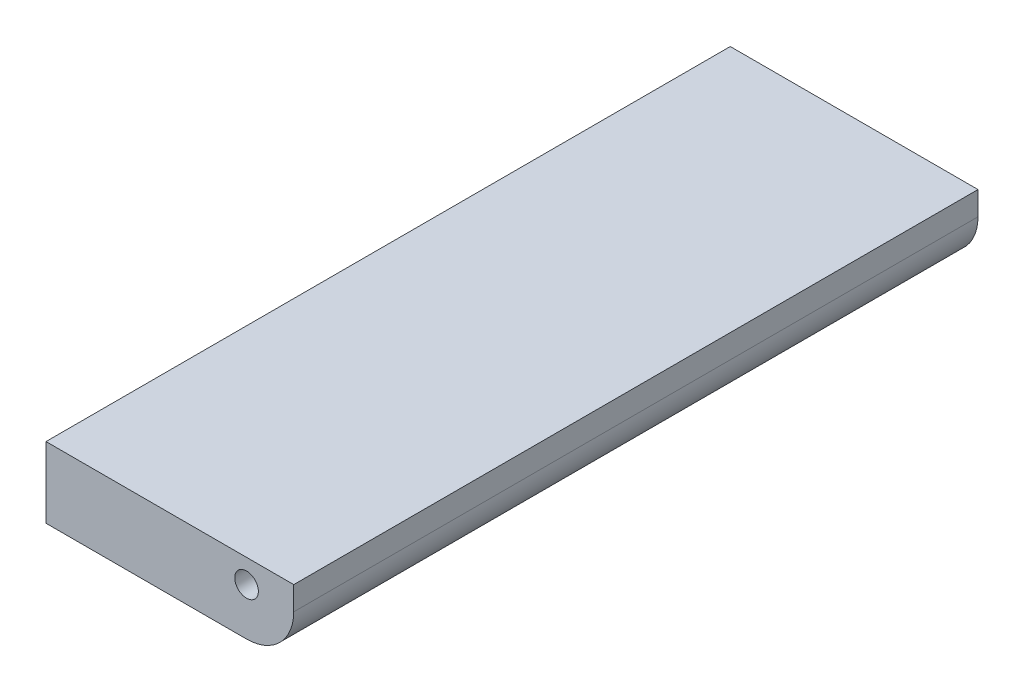
ISO-10303-21;
HEADER;
FILE_DESCRIPTION(('STEP AP214'),'2;1');
FILE_NAME('part.step','',(''),(''),'','','');
FILE_SCHEMA(('AUTOMOTIVE_DESIGN { 1 0 10303 214 1 1 1 1 }'));
ENDSEC;
DATA;
#1=APPLICATION_CONTEXT('core data for automotive mechanical design processes');
#2=APPLICATION_PROTOCOL_DEFINITION('international standard','automotive_design',2000,#1);
#3=PRODUCT_CONTEXT('',#1,'mechanical');
#4=PRODUCT('Part','Part','',(#3));
#5=PRODUCT_RELATED_PRODUCT_CATEGORY('part','',(#4));
#6=PRODUCT_DEFINITION_FORMATION('','',#4);
#7=PRODUCT_DEFINITION_CONTEXT('part definition',#1,'design');
#8=PRODUCT_DEFINITION('design','',#6,#7);
#9=PRODUCT_DEFINITION_SHAPE('','',#8);
#10=(LENGTH_UNIT() NAMED_UNIT(*) SI_UNIT(.MILLI.,.METRE.));
#11=(NAMED_UNIT(*) PLANE_ANGLE_UNIT() SI_UNIT($,.RADIAN.));
#12=(NAMED_UNIT(*) SI_UNIT($,.STERADIAN.) SOLID_ANGLE_UNIT());
#13=UNCERTAINTY_MEASURE_WITH_UNIT(LENGTH_MEASURE(1.E-05),#10,'distance_accuracy_value','');
#14=(GEOMETRIC_REPRESENTATION_CONTEXT(3) GLOBAL_UNCERTAINTY_ASSIGNED_CONTEXT((#13)) GLOBAL_UNIT_ASSIGNED_CONTEXT((#10,
#11,#12)) REPRESENTATION_CONTEXT('',''));
#15=CARTESIAN_POINT('',(0.,0.,0.));
#16=DIRECTION('',(0.,0.,1.));
#17=DIRECTION('',(1.,0.,0.));
#18=AXIS2_PLACEMENT_3D('',#15,#16,#17);
#19=CARTESIAN_POINT('',(0.,0.,290.));
#20=DIRECTION('',(-1.,0.,0.));
#21=DIRECTION('',(0.,-1.,0.));
#22=AXIS2_PLACEMENT_3D('',#19,#20,#21);
#23=PLANE('',#22);
#24=DIRECTION('',(0.,1.,0.));
#25=VECTOR('',#24,1.);
#26=CARTESIAN_POINT('',(0.,0.,0.));
#27=LINE('',#26,#25);
#28=CARTESIAN_POINT('',(0.,-10.,0.));
#29=VERTEX_POINT('',#28);
#30=CARTESIAN_POINT('',(0.,0.,0.));
#31=VERTEX_POINT('',#30);
#32=EDGE_CURVE('E110',#29,#31,#27,.T.);
#33=ORIENTED_EDGE('',*,*,#32,.T.);
#34=DIRECTION('',(0.,0.,-1.));
#35=VECTOR('',#34,1.);
#36=CARTESIAN_POINT('',(0.,0.,290.));
#37=LINE('',#36,#35);
#38=CARTESIAN_POINT('',(0.,0.,290.));
#39=VERTEX_POINT('',#38);
#40=EDGE_CURVE('E11',#39,#31,#37,.T.);
#41=ORIENTED_EDGE('',*,*,#40,.F.);
#42=DIRECTION('',(0.,1.,0.));
#43=VECTOR('',#42,1.);
#44=CARTESIAN_POINT('',(0.,0.,290.));
#45=LINE('',#44,#43);
#46=CARTESIAN_POINT('',(0.,-10.,290.));
#47=VERTEX_POINT('',#46);
#48=EDGE_CURVE('E119',#47,#39,#45,.T.);
#49=ORIENTED_EDGE('',*,*,#48,.F.);
#50=DIRECTION('',(0.,0.,-1.));
#51=VECTOR('',#50,1.);
#52=CARTESIAN_POINT('',(0.,-10.,290.));
#53=LINE('',#52,#51);
#54=EDGE_CURVE('E106',#47,#29,#53,.T.);
#55=ORIENTED_EDGE('',*,*,#54,.T.);
#56=EDGE_LOOP('',(#33,#41,#49,#55));
#57=FACE_BOUND('',#56,.T.);
#58=ADVANCED_FACE('F36',(#57),#23,.F.);
#59=CARTESIAN_POINT('',(0.,0.,290.));
#60=DIRECTION('',(0.,-1.,0.));
#61=DIRECTION('',(1.,0.,0.));
#62=AXIS2_PLACEMENT_3D('',#59,#60,#61);
#63=PLANE('',#62);
#64=DIRECTION('',(-1.,0.,0.));
#65=VECTOR('',#64,1.);
#66=CARTESIAN_POINT('',(0.,0.,0.));
#67=LINE('',#66,#65);
#68=CARTESIAN_POINT('',(-105.,0.,0.));
#69=VERTEX_POINT('',#68);
#70=EDGE_CURVE('E113',#31,#69,#67,.T.);
#71=ORIENTED_EDGE('',*,*,#70,.T.);
#72=DIRECTION('',(0.,0.,-1.));
#73=VECTOR('',#72,1.);
#74=CARTESIAN_POINT('',(-105.,0.,290.));
#75=LINE('',#74,#73);
#76=CARTESIAN_POINT('',(-105.,0.,290.));
#77=VERTEX_POINT('',#76);
#78=EDGE_CURVE('E44',#77,#69,#75,.T.);
#79=ORIENTED_EDGE('',*,*,#78,.F.);
#80=DIRECTION('',(-1.,0.,0.));
#81=VECTOR('',#80,1.);
#82=CARTESIAN_POINT('',(0.,0.,290.));
#83=LINE('',#82,#81);
#84=EDGE_CURVE('E86',#39,#77,#83,.T.);
#85=ORIENTED_EDGE('',*,*,#84,.F.);
#86=ORIENTED_EDGE('',*,*,#40,.T.);
#87=EDGE_LOOP('',(#71,#79,#85,#86));
#88=FACE_BOUND('',#87,.T.);
#89=ADVANCED_FACE('F139',(#88),#63,.F.);
#90=CARTESIAN_POINT('',(-105.,0.,290.));
#91=DIRECTION('',(1.,0.,0.));
#92=DIRECTION('',(0.,0.,-1.));
#93=AXIS2_PLACEMENT_3D('',#90,#91,#92);
#94=PLANE('',#93);
#95=DIRECTION('',(0.,-1.,0.));
#96=VECTOR('',#95,1.);
#97=CARTESIAN_POINT('',(-105.,0.,0.));
#98=LINE('',#97,#96);
#99=CARTESIAN_POINT('',(-105.,-30.,0.));
#100=VERTEX_POINT('',#99);
#101=EDGE_CURVE('E101',#69,#100,#98,.T.);
#102=ORIENTED_EDGE('',*,*,#101,.T.);
#103=DIRECTION('',(0.,0.,-1.));
#104=VECTOR('',#103,1.);
#105=CARTESIAN_POINT('',(-105.,-30.,290.));
#106=LINE('',#105,#104);
#107=CARTESIAN_POINT('',(-105.,-30.,290.));
#108=VERTEX_POINT('',#107);
#109=EDGE_CURVE('E98',#108,#100,#106,.T.);
#110=ORIENTED_EDGE('',*,*,#109,.F.);
#111=DIRECTION('',(0.,-1.,0.));
#112=VECTOR('',#111,1.);
#113=CARTESIAN_POINT('',(-105.,0.,290.));
#114=LINE('',#113,#112);
#115=EDGE_CURVE('E90',#77,#108,#114,.T.);
#116=ORIENTED_EDGE('',*,*,#115,.F.);
#117=ORIENTED_EDGE('',*,*,#78,.T.);
#118=EDGE_LOOP('',(#102,#110,#116,#117));
#119=FACE_BOUND('',#118,.T.);
#120=ADVANCED_FACE('F99',(#119),#94,.F.);
#121=CARTESIAN_POINT('',(-20.,-30.,290.));
#122=DIRECTION('',(0.,1.,0.));
#123=DIRECTION('',(-1.,0.,0.));
#124=AXIS2_PLACEMENT_3D('',#121,#122,#123);
#125=PLANE('',#124);
#126=DIRECTION('',(1.,0.,0.));
#127=VECTOR('',#126,1.);
#128=CARTESIAN_POINT('',(-20.,-30.,0.));
#129=LINE('',#128,#127);
#130=CARTESIAN_POINT('',(-20.,-30.,0.));
#131=VERTEX_POINT('',#130);
#132=EDGE_CURVE('E72',#100,#131,#129,.T.);
#133=ORIENTED_EDGE('',*,*,#132,.T.);
#134=DIRECTION('',(0.,0.,-1.));
#135=VECTOR('',#134,1.);
#136=CARTESIAN_POINT('',(-20.,-30.,290.));
#137=LINE('',#136,#135);
#138=CARTESIAN_POINT('',(-20.,-30.,290.));
#139=VERTEX_POINT('',#138);
#140=EDGE_CURVE('E102',#139,#131,#137,.T.);
#141=ORIENTED_EDGE('',*,*,#140,.F.);
#142=DIRECTION('',(1.,0.,0.));
#143=VECTOR('',#142,1.);
#144=CARTESIAN_POINT('',(-20.,-30.,290.));
#145=LINE('',#144,#143);
#146=EDGE_CURVE('E94',#108,#139,#145,.T.);
#147=ORIENTED_EDGE('',*,*,#146,.F.);
#148=ORIENTED_EDGE('',*,*,#109,.T.);
#149=EDGE_LOOP('',(#133,#141,#147,#148));
#150=FACE_BOUND('',#149,.T.);
#151=ADVANCED_FACE('F104',(#150),#125,.F.);
#152=CARTESIAN_POINT('',(-20.,-10.,290.));
#153=DIRECTION('',(0.,0.,-1.));
#154=DIRECTION('',(-1.,0.,0.));
#155=AXIS2_PLACEMENT_3D('',#152,#153,#154);
#156=CYLINDRICAL_SURFACE('',#155,20.);
#157=CARTESIAN_POINT('',(-20.,-10.,0.));
#158=DIRECTION('',(0.,0.,1.));
#159=DIRECTION('',(1.,0.,0.));
#160=AXIS2_PLACEMENT_3D('',#157,#158,#159);
#161=CIRCLE('',#160,20.);
#162=EDGE_CURVE('E78',#131,#29,#161,.T.);
#163=ORIENTED_EDGE('',*,*,#162,.T.);
#164=ORIENTED_EDGE('',*,*,#54,.F.);
#165=CARTESIAN_POINT('',(-20.,-10.,290.));
#166=DIRECTION('',(0.,0.,1.));
#167=DIRECTION('',(1.,0.,0.));
#168=AXIS2_PLACEMENT_3D('',#165,#166,#167);
#169=CIRCLE('',#168,20.);
#170=EDGE_CURVE('E52',#139,#47,#169,.T.);
#171=ORIENTED_EDGE('',*,*,#170,.F.);
#172=ORIENTED_EDGE('',*,*,#140,.T.);
#173=EDGE_LOOP('',(#163,#164,#171,#172));
#174=FACE_BOUND('',#173,.T.);
#175=ADVANCED_FACE('F127',(#174),#156,.T.);
#176=CARTESIAN_POINT('',(-20.,-10.,290.));
#177=DIRECTION('',(0.,0.,1.));
#178=DIRECTION('',(1.,0.,0.));
#179=AXIS2_PLACEMENT_3D('',#176,#177,#178);
#180=PLANE('',#179);
#181=CARTESIAN_POINT('',(-20.,-10.,290.));
#182=DIRECTION('',(0.,0.,1.));
#183=DIRECTION('',(1.,0.,0.));
#184=AXIS2_PLACEMENT_3D('',#181,#182,#183);
#185=CIRCLE('',#184,5.);
#186=CARTESIAN_POINT('',(-15.,-10.,290.));
#187=VERTEX_POINT('',#186);
#188=EDGE_CURVE('E190',#187,#187,#185,.T.);
#189=ORIENTED_EDGE('',*,*,#188,.F.);
#190=EDGE_LOOP('',(#189));
#191=FACE_BOUND('',#190,.T.);
#192=ORIENTED_EDGE('',*,*,#48,.T.);
#193=ORIENTED_EDGE('',*,*,#84,.T.);
#194=ORIENTED_EDGE('',*,*,#115,.T.);
#195=ORIENTED_EDGE('',*,*,#146,.T.);
#196=ORIENTED_EDGE('',*,*,#170,.T.);
#197=EDGE_LOOP('',(#192,#193,#194,#195,#196));
#198=FACE_BOUND('',#197,.T.);
#199=ADVANCED_FACE('F92',(#191,#198),#180,.T.);
#200=CARTESIAN_POINT('',(-20.,-10.,0.));
#201=DIRECTION('',(0.,0.,1.));
#202=DIRECTION('',(1.,0.,0.));
#203=AXIS2_PLACEMENT_3D('',#200,#201,#202);
#204=PLANE('',#203);
#205=CARTESIAN_POINT('',(-20.,-10.,0.));
#206=DIRECTION('',(0.,0.,1.));
#207=DIRECTION('',(1.,0.,0.));
#208=AXIS2_PLACEMENT_3D('',#205,#206,#207);
#209=CIRCLE('',#208,5.);
#210=CARTESIAN_POINT('',(-15.,-10.,0.));
#211=VERTEX_POINT('',#210);
#212=EDGE_CURVE('E114',#211,#211,#209,.T.);
#213=ORIENTED_EDGE('',*,*,#212,.T.);
#214=EDGE_LOOP('',(#213));
#215=FACE_BOUND('',#214,.T.);
#216=ORIENTED_EDGE('',*,*,#32,.F.);
#217=ORIENTED_EDGE('',*,*,#162,.F.);
#218=ORIENTED_EDGE('',*,*,#132,.F.);
#219=ORIENTED_EDGE('',*,*,#101,.F.);
#220=ORIENTED_EDGE('',*,*,#70,.F.);
#221=EDGE_LOOP('',(#216,#217,#218,#219,#220));
#222=FACE_BOUND('',#221,.T.);
#223=ADVANCED_FACE('F123',(#215,#222),#204,.F.);
#224=CARTESIAN_POINT('',(-20.,-10.,0.));
#225=DIRECTION('',(0.,0.,1.));
#226=DIRECTION('',(1.,0.,0.));
#227=AXIS2_PLACEMENT_3D('',#224,#225,#226);
#228=CYLINDRICAL_SURFACE('',#227,5.);
#229=ORIENTED_EDGE('',*,*,#212,.F.);
#230=EDGE_LOOP('',(#229));
#231=FACE_BOUND('',#230,.T.);
#232=ORIENTED_EDGE('',*,*,#188,.T.);
#233=EDGE_LOOP('',(#232));
#234=FACE_BOUND('',#233,.T.);
#235=ADVANCED_FACE('F172',(#231,#234),#228,.F.);
#236=CLOSED_SHELL('',(#58,#89,#120,#151,#175,#199,#223,#235));
#237=MANIFOLD_SOLID_BREP('B2',#236);
#238=ADVANCED_BREP_SHAPE_REPRESENTATION('',(#18,#237),#14);
#239=SHAPE_DEFINITION_REPRESENTATION(#9,#238);
ENDSEC;
END-ISO-10303-21;
